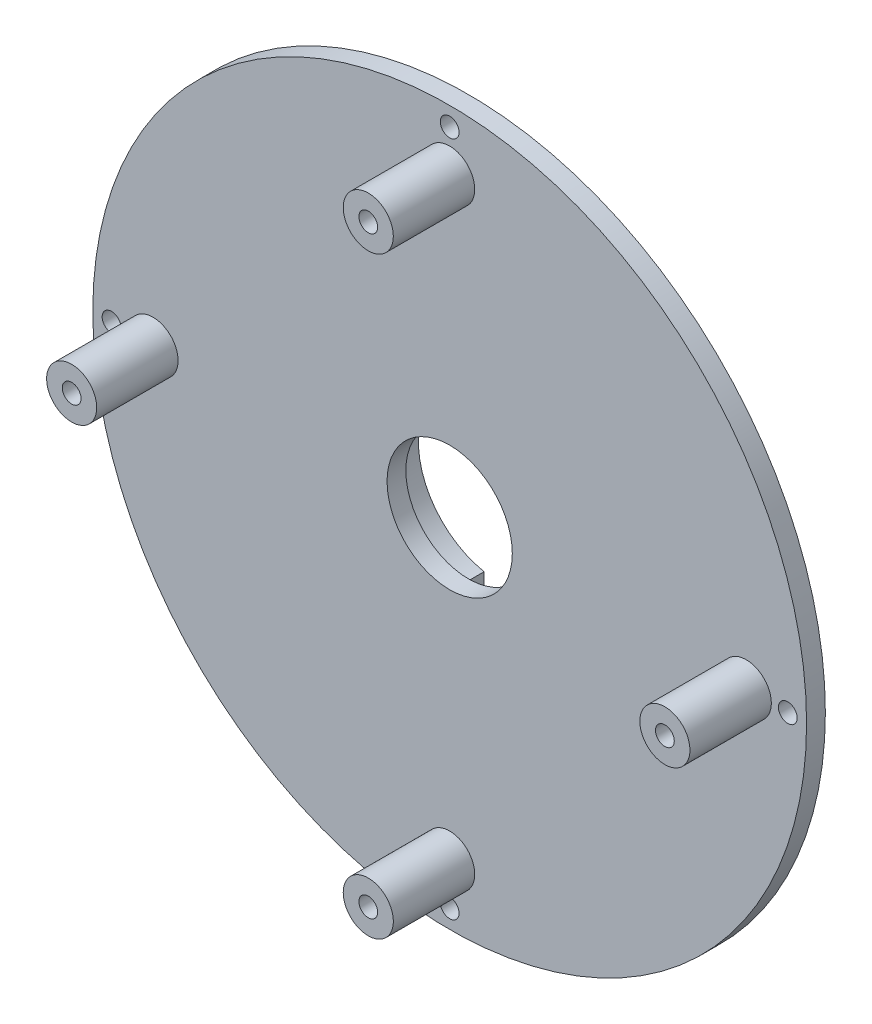
ISO-10303-21;
HEADER;
FILE_DESCRIPTION(('STEP AP214'),'2;1');
FILE_NAME('part.step','',(''),(''),'','','');
FILE_SCHEMA(('AUTOMOTIVE_DESIGN { 1 0 10303 214 1 1 1 1 }'));
ENDSEC;
DATA;
#1=APPLICATION_CONTEXT('core data for automotive mechanical design processes');
#2=APPLICATION_PROTOCOL_DEFINITION('international standard','automotive_design',2000,#1);
#3=PRODUCT_CONTEXT('',#1,'mechanical');
#4=PRODUCT('Part','Part','',(#3));
#5=PRODUCT_RELATED_PRODUCT_CATEGORY('part','',(#4));
#6=PRODUCT_DEFINITION_FORMATION('','',#4);
#7=PRODUCT_DEFINITION_CONTEXT('part definition',#1,'design');
#8=PRODUCT_DEFINITION('design','',#6,#7);
#9=PRODUCT_DEFINITION_SHAPE('','',#8);
#10=(LENGTH_UNIT() NAMED_UNIT(*) SI_UNIT(.MILLI.,.METRE.));
#11=(NAMED_UNIT(*) PLANE_ANGLE_UNIT() SI_UNIT($,.RADIAN.));
#12=(NAMED_UNIT(*) SI_UNIT($,.STERADIAN.) SOLID_ANGLE_UNIT());
#13=UNCERTAINTY_MEASURE_WITH_UNIT(LENGTH_MEASURE(1.E-05),#10,'distance_accuracy_value','');
#14=(GEOMETRIC_REPRESENTATION_CONTEXT(3) GLOBAL_UNCERTAINTY_ASSIGNED_CONTEXT((#13)) GLOBAL_UNIT_ASSIGNED_CONTEXT((#10,
#11,#12)) REPRESENTATION_CONTEXT('',''));
#15=CARTESIAN_POINT('',(0.,0.,0.));
#16=DIRECTION('',(0.,0.,1.));
#17=DIRECTION('',(1.,0.,0.));
#18=AXIS2_PLACEMENT_3D('',#15,#16,#17);
#19=CARTESIAN_POINT('',(0.,0.,-5.));
#20=DIRECTION('',(0.,0.,1.));
#21=DIRECTION('',(1.,0.,0.));
#22=AXIS2_PLACEMENT_3D('',#19,#20,#21);
#23=CYLINDRICAL_SURFACE('',#22,15.);
#24=CARTESIAN_POINT('',(0.,0.,-5.));
#25=DIRECTION('',(0.,0.,-1.));
#26=DIRECTION('',(-1.,0.,0.));
#27=AXIS2_PLACEMENT_3D('',#24,#25,#26);
#28=CIRCLE('',#27,15.);
#29=CARTESIAN_POINT('',(2.5,14.790199457749,-5.));
#30=VERTEX_POINT('',#29);
#31=CARTESIAN_POINT('',(2.5,-14.790199457749,-5.));
#32=VERTEX_POINT('',#31);
#33=EDGE_CURVE('E146',#30,#32,#28,.T.);
#34=ORIENTED_EDGE('',*,*,#33,.F.);
#35=DIRECTION('',(0.,0.,1.));
#36=VECTOR('',#35,1.);
#37=CARTESIAN_POINT('',(2.5,14.790199457749,-5.));
#38=LINE('',#37,#36);
#39=CARTESIAN_POINT('',(2.5,14.790199457749,0.));
#40=VERTEX_POINT('',#39);
#41=EDGE_CURVE('E187',#30,#40,#38,.T.);
#42=ORIENTED_EDGE('',*,*,#41,.T.);
#43=CARTESIAN_POINT('',(0.,0.,0.));
#44=DIRECTION('',(0.,0.,-1.));
#45=DIRECTION('',(-1.,0.,0.));
#46=AXIS2_PLACEMENT_3D('',#43,#44,#45);
#47=CIRCLE('',#46,15.);
#48=CARTESIAN_POINT('',(2.5,-14.790199457749,0.));
#49=VERTEX_POINT('',#48);
#50=EDGE_CURVE('E131',#40,#49,#47,.T.);
#51=ORIENTED_EDGE('',*,*,#50,.T.);
#52=DIRECTION('',(0.,0.,1.));
#53=VECTOR('',#52,1.);
#54=CARTESIAN_POINT('',(2.5,-14.790199457749,-5.));
#55=LINE('',#54,#53);
#56=EDGE_CURVE('E126',#49,#32,#55,.F.);
#57=ORIENTED_EDGE('',*,*,#56,.T.);
#58=EDGE_LOOP('',(#34,#42,#51,#57));
#59=FACE_BOUND('',#58,.T.);
#60=ADVANCED_FACE('F41',(#59),#23,.T.);
#61=CARTESIAN_POINT('',(0.,0.,-5.));
#62=DIRECTION('',(0.,0.,-1.));
#63=DIRECTION('',(-1.,0.,0.));
#64=AXIS2_PLACEMENT_3D('',#61,#62,#63);
#65=PLANE('',#64);
#66=DIRECTION('',(0.,-1.,0.));
#67=VECTOR('',#66,1.);
#68=CARTESIAN_POINT('',(2.5,-25.,-5.));
#69=LINE('',#68,#67);
#70=CARTESIAN_POINT('',(2.5,12.7573508221731,-5.));
#71=VERTEX_POINT('',#70);
#72=EDGE_CURVE('E168',#30,#71,#69,.T.);
#73=ORIENTED_EDGE('',*,*,#72,.F.);
#74=ORIENTED_EDGE('',*,*,#33,.T.);
#75=CARTESIAN_POINT('',(2.5,-12.7573508221731,-5.));
#76=VERTEX_POINT('',#75);
#77=EDGE_CURVE('E170',#76,#32,#69,.T.);
#78=ORIENTED_EDGE('',*,*,#77,.F.);
#79=CARTESIAN_POINT('',(0.,0.,-5.));
#80=DIRECTION('',(0.,0.,-1.));
#81=DIRECTION('',(-1.,0.,0.));
#82=AXIS2_PLACEMENT_3D('',#79,#80,#81);
#83=CIRCLE('',#82,13.);
#84=EDGE_CURVE('E158',#71,#76,#83,.T.);
#85=ORIENTED_EDGE('',*,*,#84,.F.);
#86=EDGE_LOOP('',(#73,#74,#78,#85));
#87=FACE_BOUND('',#86,.T.);
#88=ADVANCED_FACE('F166',(#87),#65,.T.);
#89=CARTESIAN_POINT('',(0.,0.,36.7695526217005));
#90=DIRECTION('',(0.,0.,-1.));
#91=DIRECTION('',(-1.,0.,0.));
#92=AXIS2_PLACEMENT_3D('',#89,#90,#91);
#93=CYLINDRICAL_SURFACE('',#92,13.);
#94=ORIENTED_EDGE('',*,*,#84,.T.);
#95=DIRECTION('',(0.,0.,-1.));
#96=VECTOR('',#95,1.);
#97=CARTESIAN_POINT('',(2.5,-12.7573508221731,36.7695526217005));
#98=LINE('',#97,#96);
#99=CARTESIAN_POINT('',(2.5,-12.7573508221731,0.));
#100=VERTEX_POINT('',#99);
#101=EDGE_CURVE('E11',#76,#100,#98,.F.);
#102=ORIENTED_EDGE('',*,*,#101,.T.);
#103=CARTESIAN_POINT('',(0.,0.,0.));
#104=DIRECTION('',(0.,0.,1.));
#105=DIRECTION('',(1.,0.,0.));
#106=AXIS2_PLACEMENT_3D('',#103,#104,#105);
#107=CIRCLE('',#106,13.);
#108=CARTESIAN_POINT('',(2.5,12.7573508221731,0.));
#109=VERTEX_POINT('',#108);
#110=EDGE_CURVE('E160',#109,#100,#107,.F.);
#111=ORIENTED_EDGE('',*,*,#110,.F.);
#112=DIRECTION('',(0.,0.,-1.));
#113=VECTOR('',#112,1.);
#114=CARTESIAN_POINT('',(2.5,12.7573508221731,36.7695526217005));
#115=LINE('',#114,#113);
#116=EDGE_CURVE('E50',#109,#71,#115,.T.);
#117=ORIENTED_EDGE('',*,*,#116,.T.);
#118=EDGE_LOOP('',(#94,#102,#111,#117));
#119=FACE_BOUND('',#118,.T.);
#120=ADVANCED_FACE('F157',(#119),#93,.F.);
#121=CARTESIAN_POINT('',(0.,0.,3.));
#122=DIRECTION('',(0.,0.,-1.));
#123=DIRECTION('',(-1.,0.,0.));
#124=AXIS2_PLACEMENT_3D('',#121,#122,#123);
#125=CYLINDRICAL_SURFACE('',#124,57.);
#126=CARTESIAN_POINT('',(0.,0.,3.));
#127=DIRECTION('',(0.,0.,1.));
#128=DIRECTION('',(1.,0.,0.));
#129=AXIS2_PLACEMENT_3D('',#126,#127,#128);
#130=CIRCLE('',#129,57.);
#131=CARTESIAN_POINT('',(57.,0.,3.));
#132=VERTEX_POINT('',#131);
#133=EDGE_CURVE('E132',#132,#132,#130,.T.);
#134=ORIENTED_EDGE('',*,*,#133,.F.);
#135=EDGE_LOOP('',(#134));
#136=FACE_BOUND('',#135,.T.);
#137=CARTESIAN_POINT('',(0.,0.,0.));
#138=DIRECTION('',(0.,0.,1.));
#139=DIRECTION('',(1.,0.,0.));
#140=AXIS2_PLACEMENT_3D('',#137,#138,#139);
#141=CIRCLE('',#140,57.);
#142=CARTESIAN_POINT('',(57.,0.,0.));
#143=VERTEX_POINT('',#142);
#144=EDGE_CURVE('E138',#143,#143,#141,.T.);
#145=ORIENTED_EDGE('',*,*,#144,.T.);
#146=EDGE_LOOP('',(#145));
#147=FACE_BOUND('',#146,.T.);
#148=ADVANCED_FACE('F43',(#136,#147),#125,.T.);
#149=CARTESIAN_POINT('',(0.,0.,3.));
#150=DIRECTION('',(0.,0.,1.));
#151=DIRECTION('',(1.,0.,0.));
#152=AXIS2_PLACEMENT_3D('',#149,#150,#151);
#153=PLANE('',#152);
#154=CARTESIAN_POINT('',(47.37,4.96174413062998E-13,3.));
#155=DIRECTION('',(0.,0.,1.));
#156=DIRECTION('',(0.,-1.,0.));
#157=AXIS2_PLACEMENT_3D('',#154,#155,#156);
#158=CIRCLE('',#157,4.);
#159=CARTESIAN_POINT('',(47.37,-3.9999999999995,3.));
#160=VERTEX_POINT('',#159);
#161=EDGE_CURVE('E272',#160,#160,#158,.T.);
#162=ORIENTED_EDGE('',*,*,#161,.F.);
#163=EDGE_LOOP('',(#162));
#164=FACE_BOUND('',#163,.T.);
#165=CARTESIAN_POINT('',(0.,-47.37,3.));
#166=DIRECTION('',(0.,0.,1.));
#167=DIRECTION('',(-1.,0.,0.));
#168=AXIS2_PLACEMENT_3D('',#165,#166,#167);
#169=CIRCLE('',#168,4.);
#170=CARTESIAN_POINT('',(-4.,-47.37,3.));
#171=VERTEX_POINT('',#170);
#172=EDGE_CURVE('E264',#171,#171,#169,.T.);
#173=ORIENTED_EDGE('',*,*,#172,.F.);
#174=EDGE_LOOP('',(#173));
#175=FACE_BOUND('',#174,.T.);
#176=CARTESIAN_POINT('',(-47.37,-1.65391471020999E-13,3.));
#177=DIRECTION('',(0.,0.,1.));
#178=DIRECTION('',(0.,1.,0.));
#179=AXIS2_PLACEMENT_3D('',#176,#177,#178);
#180=CIRCLE('',#179,4.);
#181=CARTESIAN_POINT('',(-47.37,3.99999999999984,3.));
#182=VERTEX_POINT('',#181);
#183=EDGE_CURVE('E256',#182,#182,#180,.T.);
#184=ORIENTED_EDGE('',*,*,#183,.F.);
#185=EDGE_LOOP('',(#184));
#186=FACE_BOUND('',#185,.T.);
#187=CARTESIAN_POINT('',(0.,47.37,3.));
#188=DIRECTION('',(0.,0.,1.));
#189=DIRECTION('',(1.,0.,0.));
#190=AXIS2_PLACEMENT_3D('',#187,#188,#189);
#191=CIRCLE('',#190,4.);
#192=CARTESIAN_POINT('',(4.,47.37,3.));
#193=VERTEX_POINT('',#192);
#194=EDGE_CURVE('E240',#193,#193,#191,.T.);
#195=ORIENTED_EDGE('',*,*,#194,.F.);
#196=EDGE_LOOP('',(#195));
#197=FACE_BOUND('',#196,.T.);
#198=CARTESIAN_POINT('',(0.,54.,3.));
#199=DIRECTION('',(0.,0.,1.));
#200=DIRECTION('',(1.,0.,0.));
#201=AXIS2_PLACEMENT_3D('',#198,#199,#200);
#202=CIRCLE('',#201,1.5);
#203=CARTESIAN_POINT('',(1.5,54.,3.));
#204=VERTEX_POINT('',#203);
#205=EDGE_CURVE('E205',#204,#204,#202,.F.);
#206=ORIENTED_EDGE('',*,*,#205,.T.);
#207=EDGE_LOOP('',(#206));
#208=FACE_BOUND('',#207,.T.);
#209=CARTESIAN_POINT('',(-54.0000000000023,2.29223882478963E-12,3.));
#210=DIRECTION('',(0.,0.,1.));
#211=DIRECTION('',(1.,0.,0.));
#212=AXIS2_PLACEMENT_3D('',#209,#210,#211);
#213=CIRCLE('',#212,1.50000000000257);
#214=CARTESIAN_POINT('',(-52.4999999999997,2.29223882478963E-12,3.));
#215=VERTEX_POINT('',#214);
#216=EDGE_CURVE('E226',#215,#215,#213,.F.);
#217=ORIENTED_EDGE('',*,*,#216,.T.);
#218=EDGE_LOOP('',(#217));
#219=FACE_BOUND('',#218,.T.);
#220=CARTESIAN_POINT('',(-4.58447764957926E-12,-54.,3.));
#221=DIRECTION('',(0.,0.,1.));
#222=DIRECTION('',(1.,0.,0.));
#223=AXIS2_PLACEMENT_3D('',#220,#221,#222);
#224=CIRCLE('',#223,1.50000000000573);
#225=CARTESIAN_POINT('',(1.50000000000115,-54.,3.));
#226=VERTEX_POINT('',#225);
#227=EDGE_CURVE('E218',#226,#226,#224,.F.);
#228=ORIENTED_EDGE('',*,*,#227,.T.);
#229=EDGE_LOOP('',(#228));
#230=FACE_BOUND('',#229,.T.);
#231=CARTESIAN_POINT('',(53.9999999999977,-2.29885191750503E-12,3.));
#232=DIRECTION('',(0.,0.,1.));
#233=DIRECTION('',(1.,0.,0.));
#234=AXIS2_PLACEMENT_3D('',#231,#232,#233);
#235=CIRCLE('',#234,1.5000000000045);
#236=CARTESIAN_POINT('',(55.5000000000022,-2.29885191750503E-12,3.));
#237=VERTEX_POINT('',#236);
#238=EDGE_CURVE('E208',#237,#237,#235,.F.);
#239=ORIENTED_EDGE('',*,*,#238,.T.);
#240=EDGE_LOOP('',(#239));
#241=FACE_BOUND('',#240,.T.);
#242=CARTESIAN_POINT('',(0.,0.,3.));
#243=DIRECTION('',(0.,0.,1.));
#244=DIRECTION('',(1.,0.,0.));
#245=AXIS2_PLACEMENT_3D('',#242,#243,#244);
#246=CIRCLE('',#245,10.);
#247=CARTESIAN_POINT('',(10.,0.,3.));
#248=VERTEX_POINT('',#247);
#249=EDGE_CURVE('E178',#248,#248,#246,.F.);
#250=ORIENTED_EDGE('',*,*,#249,.T.);
#251=EDGE_LOOP('',(#250));
#252=FACE_BOUND('',#251,.T.);
#253=ORIENTED_EDGE('',*,*,#133,.T.);
#254=EDGE_LOOP('',(#253));
#255=FACE_BOUND('',#254,.T.);
#256=ADVANCED_FACE('F320',(#164,#175,#186,#197,#208,#219,#230,#241,#252,#255),#153,.T.);
#257=CARTESIAN_POINT('',(0.,0.,0.));
#258=DIRECTION('',(0.,0.,1.));
#259=DIRECTION('',(1.,0.,0.));
#260=AXIS2_PLACEMENT_3D('',#257,#258,#259);
#261=PLANE('',#260);
#262=CARTESIAN_POINT('',(0.,54.,0.));
#263=DIRECTION('',(0.,0.,-1.));
#264=DIRECTION('',(-1.,0.,0.));
#265=AXIS2_PLACEMENT_3D('',#262,#263,#264);
#266=CIRCLE('',#265,1.5);
#267=CARTESIAN_POINT('',(-1.5,54.,0.));
#268=VERTEX_POINT('',#267);
#269=EDGE_CURVE('E230',#268,#268,#266,.T.);
#270=ORIENTED_EDGE('',*,*,#269,.F.);
#271=EDGE_LOOP('',(#270));
#272=FACE_BOUND('',#271,.T.);
#273=CARTESIAN_POINT('',(-54.0000000000023,2.29223882478963E-12,0.));
#274=DIRECTION('',(0.,0.,-1.));
#275=DIRECTION('',(-1.,0.,0.));
#276=AXIS2_PLACEMENT_3D('',#273,#274,#275);
#277=CIRCLE('',#276,1.50000000000257);
#278=CARTESIAN_POINT('',(-55.5000000000049,2.29223882478963E-12,0.));
#279=VERTEX_POINT('',#278);
#280=EDGE_CURVE('E222',#279,#279,#277,.T.);
#281=ORIENTED_EDGE('',*,*,#280,.F.);
#282=EDGE_LOOP('',(#281));
#283=FACE_BOUND('',#282,.T.);
#284=CARTESIAN_POINT('',(-4.58447764957926E-12,-54.,0.));
#285=DIRECTION('',(0.,0.,-1.));
#286=DIRECTION('',(-1.,0.,0.));
#287=AXIS2_PLACEMENT_3D('',#284,#285,#286);
#288=CIRCLE('',#287,1.50000000000573);
#289=CARTESIAN_POINT('',(-1.50000000001032,-54.,0.));
#290=VERTEX_POINT('',#289);
#291=EDGE_CURVE('E212',#290,#290,#288,.T.);
#292=ORIENTED_EDGE('',*,*,#291,.F.);
#293=EDGE_LOOP('',(#292));
#294=FACE_BOUND('',#293,.T.);
#295=CARTESIAN_POINT('',(53.9999999999977,-2.29885191750503E-12,0.));
#296=DIRECTION('',(0.,0.,-1.));
#297=DIRECTION('',(-1.,0.,0.));
#298=AXIS2_PLACEMENT_3D('',#295,#296,#297);
#299=CIRCLE('',#298,1.5000000000045);
#300=CARTESIAN_POINT('',(52.4999999999932,-2.29885191750503E-12,0.));
#301=VERTEX_POINT('',#300);
#302=EDGE_CURVE('E213',#301,#301,#299,.T.);
#303=ORIENTED_EDGE('',*,*,#302,.F.);
#304=EDGE_LOOP('',(#303));
#305=FACE_BOUND('',#304,.T.);
#306=DIRECTION('',(0.,-1.,0.));
#307=VECTOR('',#306,1.);
#308=CARTESIAN_POINT('',(2.5,-25.,0.));
#309=LINE('',#308,#307);
#310=EDGE_CURVE('E196',#100,#49,#309,.T.);
#311=ORIENTED_EDGE('',*,*,#310,.T.);
#312=ORIENTED_EDGE('',*,*,#50,.F.);
#313=EDGE_CURVE('E199',#40,#109,#309,.T.);
#314=ORIENTED_EDGE('',*,*,#313,.T.);
#315=ORIENTED_EDGE('',*,*,#110,.T.);
#316=EDGE_LOOP('',(#311,#312,#314,#315));
#317=FACE_BOUND('',#316,.T.);
#318=DIRECTION('',(0.,1.,0.));
#319=VECTOR('',#318,1.);
#320=CARTESIAN_POINT('',(-2.5,-25.,0.));
#321=LINE('',#320,#319);
#322=CARTESIAN_POINT('',(-2.5,12.7573508221731,0.));
#323=VERTEX_POINT('',#322);
#324=CARTESIAN_POINT('',(-2.5,14.790199457749,0.));
#325=VERTEX_POINT('',#324);
#326=EDGE_CURVE('E57',#323,#325,#321,.T.);
#327=ORIENTED_EDGE('',*,*,#326,.T.);
#328=CARTESIAN_POINT('',(-2.5,-14.790199457749,0.));
#329=VERTEX_POINT('',#328);
#330=EDGE_CURVE('E122',#329,#325,#47,.T.);
#331=ORIENTED_EDGE('',*,*,#330,.F.);
#332=CARTESIAN_POINT('',(-2.5,-12.7573508221731,0.));
#333=VERTEX_POINT('',#332);
#334=EDGE_CURVE('E105',#329,#333,#321,.T.);
#335=ORIENTED_EDGE('',*,*,#334,.T.);
#336=EDGE_CURVE('E176',#333,#323,#107,.F.);
#337=ORIENTED_EDGE('',*,*,#336,.T.);
#338=EDGE_LOOP('',(#327,#331,#335,#337));
#339=FACE_BOUND('',#338,.T.);
#340=ORIENTED_EDGE('',*,*,#144,.F.);
#341=EDGE_LOOP('',(#340));
#342=FACE_BOUND('',#341,.T.);
#343=CARTESIAN_POINT('',(0.,0.,0.));
#344=DIRECTION('',(0.,0.,-1.));
#345=DIRECTION('',(-1.,0.,0.));
#346=AXIS2_PLACEMENT_3D('',#343,#344,#345);
#347=CIRCLE('',#346,10.);
#348=CARTESIAN_POINT('',(-10.,0.,0.));
#349=VERTEX_POINT('',#348);
#350=EDGE_CURVE('E183',#349,#349,#347,.T.);
#351=ORIENTED_EDGE('',*,*,#350,.F.);
#352=EDGE_LOOP('',(#351));
#353=FACE_BOUND('',#352,.T.);
#354=ADVANCED_FACE('F128',(#272,#283,#294,#305,#317,#339,#342,#353),#261,.F.);
#355=CARTESIAN_POINT('',(-2.5,-14.790199457749,-5.));
#356=VERTEX_POINT('',#355);
#357=CARTESIAN_POINT('',(-2.5,14.790199457749,-5.));
#358=VERTEX_POINT('',#357);
#359=EDGE_CURVE('E124',#356,#358,#28,.T.);
#360=ORIENTED_EDGE('',*,*,#359,.F.);
#361=DIRECTION('',(0.,0.,1.));
#362=VECTOR('',#361,1.);
#363=CARTESIAN_POINT('',(-2.5,-14.790199457749,-5.));
#364=LINE('',#363,#362);
#365=EDGE_CURVE('E108',#356,#329,#364,.T.);
#366=ORIENTED_EDGE('',*,*,#365,.T.);
#367=ORIENTED_EDGE('',*,*,#330,.T.);
#368=DIRECTION('',(0.,0.,1.));
#369=VECTOR('',#368,1.);
#370=CARTESIAN_POINT('',(-2.5,14.790199457749,-5.));
#371=LINE('',#370,#369);
#372=EDGE_CURVE('E115',#325,#358,#371,.F.);
#373=ORIENTED_EDGE('',*,*,#372,.T.);
#374=EDGE_LOOP('',(#360,#366,#367,#373));
#375=FACE_BOUND('',#374,.T.);
#376=ADVANCED_FACE('F120',(#375),#23,.T.);
#377=DIRECTION('',(0.,1.,0.));
#378=VECTOR('',#377,1.);
#379=CARTESIAN_POINT('',(-2.5,-25.,-5.));
#380=LINE('',#379,#378);
#381=CARTESIAN_POINT('',(-2.5,-12.7573508221731,-5.));
#382=VERTEX_POINT('',#381);
#383=EDGE_CURVE('E65',#356,#382,#380,.T.);
#384=ORIENTED_EDGE('',*,*,#383,.F.);
#385=ORIENTED_EDGE('',*,*,#359,.T.);
#386=CARTESIAN_POINT('',(-2.5,12.7573508221731,-5.));
#387=VERTEX_POINT('',#386);
#388=EDGE_CURVE('E202',#387,#358,#380,.T.);
#389=ORIENTED_EDGE('',*,*,#388,.F.);
#390=EDGE_CURVE('E172',#382,#387,#83,.T.);
#391=ORIENTED_EDGE('',*,*,#390,.F.);
#392=EDGE_LOOP('',(#384,#385,#389,#391));
#393=FACE_BOUND('',#392,.T.);
#394=ADVANCED_FACE('F360',(#393),#65,.T.);
#395=ORIENTED_EDGE('',*,*,#390,.T.);
#396=DIRECTION('',(0.,0.,-1.));
#397=VECTOR('',#396,1.);
#398=CARTESIAN_POINT('',(-2.5,12.7573508221731,36.7695526217005));
#399=LINE('',#398,#397);
#400=EDGE_CURVE('E149',#387,#323,#399,.F.);
#401=ORIENTED_EDGE('',*,*,#400,.T.);
#402=ORIENTED_EDGE('',*,*,#336,.F.);
#403=DIRECTION('',(0.,0.,-1.));
#404=VECTOR('',#403,1.);
#405=CARTESIAN_POINT('',(-2.5,-12.7573508221731,36.7695526217005));
#406=LINE('',#405,#404);
#407=EDGE_CURVE('E109',#333,#382,#406,.T.);
#408=ORIENTED_EDGE('',*,*,#407,.T.);
#409=EDGE_LOOP('',(#395,#401,#402,#408));
#410=FACE_BOUND('',#409,.T.);
#411=ADVANCED_FACE('F351',(#410),#93,.F.);
#412=CARTESIAN_POINT('',(0.,0.,31.2842712474619));
#413=DIRECTION('',(0.,0.,-1.));
#414=DIRECTION('',(-1.,0.,0.));
#415=AXIS2_PLACEMENT_3D('',#412,#413,#414);
#416=CYLINDRICAL_SURFACE('',#415,10.);
#417=ORIENTED_EDGE('',*,*,#350,.T.);
#418=EDGE_LOOP('',(#417));
#419=FACE_BOUND('',#418,.T.);
#420=ORIENTED_EDGE('',*,*,#249,.F.);
#421=EDGE_LOOP('',(#420));
#422=FACE_BOUND('',#421,.T.);
#423=ADVANCED_FACE('F347',(#419,#422),#416,.F.);
#424=CARTESIAN_POINT('',(2.5,-25.,50.2493781056045));
#425=DIRECTION('',(1.,0.,0.));
#426=DIRECTION('',(0.,0.,-1.));
#427=AXIS2_PLACEMENT_3D('',#424,#425,#426);
#428=PLANE('',#427);
#429=ORIENTED_EDGE('',*,*,#310,.F.);
#430=ORIENTED_EDGE('',*,*,#101,.F.);
#431=ORIENTED_EDGE('',*,*,#77,.T.);
#432=ORIENTED_EDGE('',*,*,#56,.F.);
#433=EDGE_LOOP('',(#429,#430,#431,#432));
#434=FACE_BOUND('',#433,.T.);
#435=ADVANCED_FACE('F350',(#434),#428,.F.);
#436=CARTESIAN_POINT('',(-2.5,-25.,50.2493781056045));
#437=DIRECTION('',(-1.,0.,0.));
#438=DIRECTION('',(0.,0.,1.));
#439=AXIS2_PLACEMENT_3D('',#436,#437,#438);
#440=PLANE('',#439);
#441=ORIENTED_EDGE('',*,*,#383,.T.);
#442=ORIENTED_EDGE('',*,*,#407,.F.);
#443=ORIENTED_EDGE('',*,*,#334,.F.);
#444=ORIENTED_EDGE('',*,*,#365,.F.);
#445=EDGE_LOOP('',(#441,#442,#443,#444));
#446=FACE_BOUND('',#445,.T.);
#447=ADVANCED_FACE('F107',(#446),#440,.F.);
#448=ORIENTED_EDGE('',*,*,#72,.T.);
#449=ORIENTED_EDGE('',*,*,#116,.F.);
#450=ORIENTED_EDGE('',*,*,#313,.F.);
#451=ORIENTED_EDGE('',*,*,#41,.F.);
#452=EDGE_LOOP('',(#448,#449,#450,#451));
#453=FACE_BOUND('',#452,.T.);
#454=ADVANCED_FACE('F359',(#453),#428,.F.);
#455=ORIENTED_EDGE('',*,*,#326,.F.);
#456=ORIENTED_EDGE('',*,*,#400,.F.);
#457=ORIENTED_EDGE('',*,*,#388,.T.);
#458=ORIENTED_EDGE('',*,*,#372,.F.);
#459=EDGE_LOOP('',(#455,#456,#457,#458));
#460=FACE_BOUND('',#459,.T.);
#461=ADVANCED_FACE('F387',(#460),#440,.F.);
#462=CARTESIAN_POINT('',(53.9999999999977,-2.29885191750503E-12,7.2426406871355));
#463=DIRECTION('',(0.,0.,-1.));
#464=DIRECTION('',(-1.,0.,0.));
#465=AXIS2_PLACEMENT_3D('',#462,#463,#464);
#466=CYLINDRICAL_SURFACE('',#465,1.5000000000045);
#467=ORIENTED_EDGE('',*,*,#302,.T.);
#468=EDGE_LOOP('',(#467));
#469=FACE_BOUND('',#468,.T.);
#470=ORIENTED_EDGE('',*,*,#238,.F.);
#471=EDGE_LOOP('',(#470));
#472=FACE_BOUND('',#471,.T.);
#473=ADVANCED_FACE('F389',(#469,#472),#466,.F.);
#474=CARTESIAN_POINT('',(-4.58447764957926E-12,-54.,7.2426406871355));
#475=DIRECTION('',(0.,0.,-1.));
#476=DIRECTION('',(-1.,0.,0.));
#477=AXIS2_PLACEMENT_3D('',#474,#475,#476);
#478=CYLINDRICAL_SURFACE('',#477,1.50000000000573);
#479=ORIENTED_EDGE('',*,*,#291,.T.);
#480=EDGE_LOOP('',(#479));
#481=FACE_BOUND('',#480,.T.);
#482=ORIENTED_EDGE('',*,*,#227,.F.);
#483=EDGE_LOOP('',(#482));
#484=FACE_BOUND('',#483,.T.);
#485=ADVANCED_FACE('F395',(#481,#484),#478,.F.);
#486=CARTESIAN_POINT('',(-54.0000000000023,2.29223882478963E-12,7.2426406871355));
#487=DIRECTION('',(0.,0.,-1.));
#488=DIRECTION('',(-1.,0.,0.));
#489=AXIS2_PLACEMENT_3D('',#486,#487,#488);
#490=CYLINDRICAL_SURFACE('',#489,1.50000000000257);
#491=ORIENTED_EDGE('',*,*,#280,.T.);
#492=EDGE_LOOP('',(#491));
#493=FACE_BOUND('',#492,.T.);
#494=ORIENTED_EDGE('',*,*,#216,.F.);
#495=EDGE_LOOP('',(#494));
#496=FACE_BOUND('',#495,.T.);
#497=ADVANCED_FACE('F434',(#493,#496),#490,.F.);
#498=CARTESIAN_POINT('',(0.,54.,7.2426406871355));
#499=DIRECTION('',(0.,0.,-1.));
#500=DIRECTION('',(-1.,0.,0.));
#501=AXIS2_PLACEMENT_3D('',#498,#499,#500);
#502=CYLINDRICAL_SURFACE('',#501,1.5);
#503=ORIENTED_EDGE('',*,*,#269,.T.);
#504=EDGE_LOOP('',(#503));
#505=FACE_BOUND('',#504,.T.);
#506=ORIENTED_EDGE('',*,*,#205,.F.);
#507=EDGE_LOOP('',(#506));
#508=FACE_BOUND('',#507,.T.);
#509=ADVANCED_FACE('F444',(#505,#508),#502,.F.);
#510=CARTESIAN_POINT('',(0.,47.37,16.));
#511=DIRECTION('',(0.,0.,-1.));
#512=DIRECTION('',(-1.,0.,0.));
#513=AXIS2_PLACEMENT_3D('',#510,#511,#512);
#514=CYLINDRICAL_SURFACE('',#513,4.);
#515=CARTESIAN_POINT('',(0.,47.37,16.));
#516=DIRECTION('',(0.,0.,1.));
#517=DIRECTION('',(1.,0.,0.));
#518=AXIS2_PLACEMENT_3D('',#515,#516,#517);
#519=CIRCLE('',#518,4.);
#520=CARTESIAN_POINT('',(4.,47.37,16.));
#521=VERTEX_POINT('',#520);
#522=EDGE_CURVE('E217',#521,#521,#519,.T.);
#523=ORIENTED_EDGE('',*,*,#522,.F.);
#524=EDGE_LOOP('',(#523));
#525=FACE_BOUND('',#524,.T.);
#526=ORIENTED_EDGE('',*,*,#194,.T.);
#527=EDGE_LOOP('',(#526));
#528=FACE_BOUND('',#527,.T.);
#529=ADVANCED_FACE('F454',(#525,#528),#514,.T.);
#530=CARTESIAN_POINT('',(0.,47.37,16.));
#531=DIRECTION('',(0.,0.,1.));
#532=DIRECTION('',(1.,0.,0.));
#533=AXIS2_PLACEMENT_3D('',#530,#531,#532);
#534=PLANE('',#533);
#535=CARTESIAN_POINT('',(0.,47.37,16.));
#536=DIRECTION('',(0.,0.,1.));
#537=DIRECTION('',(1.,0.,0.));
#538=AXIS2_PLACEMENT_3D('',#535,#536,#537);
#539=CIRCLE('',#538,1.5);
#540=CARTESIAN_POINT('',(1.5,47.37,16.));
#541=VERTEX_POINT('',#540);
#542=EDGE_CURVE('E251',#541,#541,#539,.T.);
#543=ORIENTED_EDGE('',*,*,#542,.F.);
#544=EDGE_LOOP('',(#543));
#545=FACE_BOUND('',#544,.T.);
#546=ORIENTED_EDGE('',*,*,#522,.T.);
#547=EDGE_LOOP('',(#546));
#548=FACE_BOUND('',#547,.T.);
#549=ADVANCED_FACE('F464',(#545,#548),#534,.T.);
#550=CARTESIAN_POINT('',(0.,47.37,-1.24264068711929));
#551=DIRECTION('',(0.,0.,1.));
#552=DIRECTION('',(1.,0.,0.));
#553=AXIS2_PLACEMENT_3D('',#550,#551,#552);
#554=CYLINDRICAL_SURFACE('',#553,1.5);
#555=CARTESIAN_POINT('',(0.,47.37,3.));
#556=DIRECTION('',(0.,0.,1.));
#557=DIRECTION('',(1.,0.,0.));
#558=AXIS2_PLACEMENT_3D('',#555,#556,#557);
#559=CIRCLE('',#558,1.5);
#560=CARTESIAN_POINT('',(1.5,47.37,3.));
#561=VERTEX_POINT('',#560);
#562=EDGE_CURVE('E244',#561,#561,#559,.F.);
#563=ORIENTED_EDGE('',*,*,#562,.T.);
#564=EDGE_LOOP('',(#563));
#565=FACE_BOUND('',#564,.T.);
#566=ORIENTED_EDGE('',*,*,#542,.T.);
#567=EDGE_LOOP('',(#566));
#568=FACE_BOUND('',#567,.T.);
#569=ADVANCED_FACE('F474',(#565,#568),#554,.F.);
#570=CARTESIAN_POINT('',(0.,0.,3.));
#571=DIRECTION('',(0.,0.,1.));
#572=DIRECTION('',(1.,0.,0.));
#573=AXIS2_PLACEMENT_3D('',#570,#571,#572);
#574=PLANE('',#573);
#575=ORIENTED_EDGE('',*,*,#562,.F.);
#576=EDGE_LOOP('',(#575));
#577=FACE_BOUND('',#576,.T.);
#578=ADVANCED_FACE('F316',(#577),#574,.T.);
#579=CARTESIAN_POINT('',(-47.37,-1.65391471020999E-13,16.));
#580=DIRECTION('',(0.,0.,-1.));
#581=DIRECTION('',(-1.,0.,0.));
#582=AXIS2_PLACEMENT_3D('',#579,#580,#581);
#583=CYLINDRICAL_SURFACE('',#582,4.);
#584=CARTESIAN_POINT('',(-47.37,-1.65391471020999E-13,16.));
#585=DIRECTION('',(0.,0.,1.));
#586=DIRECTION('',(0.,1.,0.));
#587=AXIS2_PLACEMENT_3D('',#584,#585,#586);
#588=CIRCLE('',#587,4.);
#589=CARTESIAN_POINT('',(-47.37,3.99999999999984,16.));
#590=VERTEX_POINT('',#589);
#591=EDGE_CURVE('E255',#590,#590,#588,.T.);
#592=ORIENTED_EDGE('',*,*,#591,.F.);
#593=EDGE_LOOP('',(#592));
#594=FACE_BOUND('',#593,.T.);
#595=ORIENTED_EDGE('',*,*,#183,.T.);
#596=EDGE_LOOP('',(#595));
#597=FACE_BOUND('',#596,.T.);
#598=ADVANCED_FACE('F310',(#594,#597),#583,.T.);
#599=CARTESIAN_POINT('',(-47.37,-1.65391471020999E-13,16.));
#600=DIRECTION('',(0.,0.,1.));
#601=DIRECTION('',(0.,1.,0.));
#602=AXIS2_PLACEMENT_3D('',#599,#600,#601);
#603=PLANE('',#602);
#604=CARTESIAN_POINT('',(-47.37,-1.65391471020999E-13,16.));
#605=DIRECTION('',(0.,0.,1.));
#606=DIRECTION('',(0.,1.,0.));
#607=AXIS2_PLACEMENT_3D('',#604,#605,#606);
#608=CIRCLE('',#607,1.5);
#609=CARTESIAN_POINT('',(-47.37,1.49999999999984,16.));
#610=VERTEX_POINT('',#609);
#611=EDGE_CURVE('E293',#610,#610,#608,.T.);
#612=ORIENTED_EDGE('',*,*,#611,.F.);
#613=EDGE_LOOP('',(#612));
#614=FACE_BOUND('',#613,.T.);
#615=ORIENTED_EDGE('',*,*,#591,.T.);
#616=EDGE_LOOP('',(#615));
#617=FACE_BOUND('',#616,.T.);
#618=ADVANCED_FACE('F306',(#614,#617),#603,.T.);
#619=CARTESIAN_POINT('',(0.,-47.37,16.));
#620=DIRECTION('',(0.,0.,-1.));
#621=DIRECTION('',(-1.,0.,0.));
#622=AXIS2_PLACEMENT_3D('',#619,#620,#621);
#623=CYLINDRICAL_SURFACE('',#622,4.);
#624=CARTESIAN_POINT('',(0.,-47.37,16.));
#625=DIRECTION('',(0.,0.,1.));
#626=DIRECTION('',(-1.,0.,0.));
#627=AXIS2_PLACEMENT_3D('',#624,#625,#626);
#628=CIRCLE('',#627,4.);
#629=CARTESIAN_POINT('',(-4.,-47.37,16.));
#630=VERTEX_POINT('',#629);
#631=EDGE_CURVE('E260',#630,#630,#628,.T.);
#632=ORIENTED_EDGE('',*,*,#631,.F.);
#633=EDGE_LOOP('',(#632));
#634=FACE_BOUND('',#633,.T.);
#635=ORIENTED_EDGE('',*,*,#172,.T.);
#636=EDGE_LOOP('',(#635));
#637=FACE_BOUND('',#636,.T.);
#638=ADVANCED_FACE('F309',(#634,#637),#623,.T.);
#639=CARTESIAN_POINT('',(0.,-47.37,16.));
#640=DIRECTION('',(0.,0.,1.));
#641=DIRECTION('',(-1.,0.,0.));
#642=AXIS2_PLACEMENT_3D('',#639,#640,#641);
#643=PLANE('',#642);
#644=CARTESIAN_POINT('',(0.,-47.37,16.));
#645=DIRECTION('',(0.,0.,1.));
#646=DIRECTION('',(-1.,0.,0.));
#647=AXIS2_PLACEMENT_3D('',#644,#645,#646);
#648=CIRCLE('',#647,1.5);
#649=CARTESIAN_POINT('',(-1.5,-47.37,16.));
#650=VERTEX_POINT('',#649);
#651=EDGE_CURVE('E284',#650,#650,#648,.T.);
#652=ORIENTED_EDGE('',*,*,#651,.F.);
#653=EDGE_LOOP('',(#652));
#654=FACE_BOUND('',#653,.T.);
#655=ORIENTED_EDGE('',*,*,#631,.T.);
#656=EDGE_LOOP('',(#655));
#657=FACE_BOUND('',#656,.T.);
#658=ADVANCED_FACE('F522',(#654,#657),#643,.T.);
#659=CARTESIAN_POINT('',(47.37,4.96174413062998E-13,16.));
#660=DIRECTION('',(0.,0.,-1.));
#661=DIRECTION('',(-1.,0.,0.));
#662=AXIS2_PLACEMENT_3D('',#659,#660,#661);
#663=CYLINDRICAL_SURFACE('',#662,4.);
#664=CARTESIAN_POINT('',(47.37,4.96174413062998E-13,16.));
#665=DIRECTION('',(0.,0.,1.));
#666=DIRECTION('',(0.,-1.,0.));
#667=AXIS2_PLACEMENT_3D('',#664,#665,#666);
#668=CIRCLE('',#667,4.);
#669=CARTESIAN_POINT('',(47.37,-3.9999999999995,16.));
#670=VERTEX_POINT('',#669);
#671=EDGE_CURVE('E268',#670,#670,#668,.T.);
#672=ORIENTED_EDGE('',*,*,#671,.F.);
#673=EDGE_LOOP('',(#672));
#674=FACE_BOUND('',#673,.T.);
#675=ORIENTED_EDGE('',*,*,#161,.T.);
#676=EDGE_LOOP('',(#675));
#677=FACE_BOUND('',#676,.T.);
#678=ADVANCED_FACE('F532',(#674,#677),#663,.T.);
#679=CARTESIAN_POINT('',(47.37,4.96174413062998E-13,16.));
#680=DIRECTION('',(0.,0.,1.));
#681=DIRECTION('',(0.,-1.,0.));
#682=AXIS2_PLACEMENT_3D('',#679,#680,#681);
#683=PLANE('',#682);
#684=CARTESIAN_POINT('',(47.37,4.96174413062998E-13,16.));
#685=DIRECTION('',(0.,0.,1.));
#686=DIRECTION('',(0.,-1.,0.));
#687=AXIS2_PLACEMENT_3D('',#684,#685,#686);
#688=CIRCLE('',#687,1.5);
#689=CARTESIAN_POINT('',(47.37,-1.4999999999995,16.));
#690=VERTEX_POINT('',#689);
#691=EDGE_CURVE('E285',#690,#690,#688,.T.);
#692=ORIENTED_EDGE('',*,*,#691,.F.);
#693=EDGE_LOOP('',(#692));
#694=FACE_BOUND('',#693,.T.);
#695=ORIENTED_EDGE('',*,*,#671,.T.);
#696=EDGE_LOOP('',(#695));
#697=FACE_BOUND('',#696,.T.);
#698=ADVANCED_FACE('F542',(#694,#697),#683,.T.);
#699=CARTESIAN_POINT('',(47.37,4.96174413062998E-13,-1.24264068711929));
#700=DIRECTION('',(0.,0.,1.));
#701=DIRECTION('',(1.,0.,0.));
#702=AXIS2_PLACEMENT_3D('',#699,#700,#701);
#703=CYLINDRICAL_SURFACE('',#702,1.5);
#704=CARTESIAN_POINT('',(47.37,4.96174413062998E-13,3.));
#705=DIRECTION('',(0.,0.,1.));
#706=DIRECTION('',(1.,0.,0.));
#707=AXIS2_PLACEMENT_3D('',#704,#705,#706);
#708=CIRCLE('',#707,1.5);
#709=CARTESIAN_POINT('',(48.87,4.96174413062998E-13,3.));
#710=VERTEX_POINT('',#709);
#711=EDGE_CURVE('E280',#710,#710,#708,.F.);
#712=ORIENTED_EDGE('',*,*,#711,.T.);
#713=EDGE_LOOP('',(#712));
#714=FACE_BOUND('',#713,.T.);
#715=ORIENTED_EDGE('',*,*,#691,.T.);
#716=EDGE_LOOP('',(#715));
#717=FACE_BOUND('',#716,.T.);
#718=ADVANCED_FACE('F552',(#714,#717),#703,.F.);
#719=CARTESIAN_POINT('',(0.,0.,3.));
#720=DIRECTION('',(0.,0.,1.));
#721=DIRECTION('',(1.,0.,0.));
#722=AXIS2_PLACEMENT_3D('',#719,#720,#721);
#723=PLANE('',#722);
#724=ORIENTED_EDGE('',*,*,#711,.F.);
#725=EDGE_LOOP('',(#724));
#726=FACE_BOUND('',#725,.T.);
#727=ADVANCED_FACE('F562',(#726),#723,.T.);
#728=CARTESIAN_POINT('',(0.,-47.37,-1.24264068711929));
#729=DIRECTION('',(0.,0.,1.));
#730=DIRECTION('',(1.,0.,0.));
#731=AXIS2_PLACEMENT_3D('',#728,#729,#730);
#732=CYLINDRICAL_SURFACE('',#731,1.5);
#733=CARTESIAN_POINT('',(0.,-47.37,3.));
#734=DIRECTION('',(0.,0.,1.));
#735=DIRECTION('',(1.,0.,0.));
#736=AXIS2_PLACEMENT_3D('',#733,#734,#735);
#737=CIRCLE('',#736,1.5);
#738=CARTESIAN_POINT('',(1.5,-47.37,3.));
#739=VERTEX_POINT('',#738);
#740=EDGE_CURVE('E289',#739,#739,#737,.F.);
#741=ORIENTED_EDGE('',*,*,#740,.T.);
#742=EDGE_LOOP('',(#741));
#743=FACE_BOUND('',#742,.T.);
#744=ORIENTED_EDGE('',*,*,#651,.T.);
#745=EDGE_LOOP('',(#744));
#746=FACE_BOUND('',#745,.T.);
#747=ADVANCED_FACE('F572',(#743,#746),#732,.F.);
#748=CARTESIAN_POINT('',(0.,0.,3.));
#749=DIRECTION('',(0.,0.,1.));
#750=DIRECTION('',(1.,0.,0.));
#751=AXIS2_PLACEMENT_3D('',#748,#749,#750);
#752=PLANE('',#751);
#753=ORIENTED_EDGE('',*,*,#740,.F.);
#754=EDGE_LOOP('',(#753));
#755=FACE_BOUND('',#754,.T.);
#756=ADVANCED_FACE('F582',(#755),#752,.T.);
#757=CARTESIAN_POINT('',(-47.37,-1.65391471020999E-13,-1.24264068711929));
#758=DIRECTION('',(0.,0.,1.));
#759=DIRECTION('',(1.,0.,0.));
#760=AXIS2_PLACEMENT_3D('',#757,#758,#759);
#761=CYLINDRICAL_SURFACE('',#760,1.5);
#762=CARTESIAN_POINT('',(-47.37,-1.65391471020999E-13,3.));
#763=DIRECTION('',(0.,0.,1.));
#764=DIRECTION('',(1.,0.,0.));
#765=AXIS2_PLACEMENT_3D('',#762,#763,#764);
#766=CIRCLE('',#765,1.5);
#767=CARTESIAN_POINT('',(-45.87,-1.65391471020999E-13,3.));
#768=VERTEX_POINT('',#767);
#769=EDGE_CURVE('E276',#768,#768,#766,.F.);
#770=ORIENTED_EDGE('',*,*,#769,.T.);
#771=EDGE_LOOP('',(#770));
#772=FACE_BOUND('',#771,.T.);
#773=ORIENTED_EDGE('',*,*,#611,.T.);
#774=EDGE_LOOP('',(#773));
#775=FACE_BOUND('',#774,.T.);
#776=ADVANCED_FACE('F304',(#772,#775),#761,.F.);
#777=CARTESIAN_POINT('',(0.,0.,3.));
#778=DIRECTION('',(0.,0.,1.));
#779=DIRECTION('',(1.,0.,0.));
#780=AXIS2_PLACEMENT_3D('',#777,#778,#779);
#781=PLANE('',#780);
#782=ORIENTED_EDGE('',*,*,#769,.F.);
#783=EDGE_LOOP('',(#782));
#784=FACE_BOUND('',#783,.T.);
#785=ADVANCED_FACE('F601',(#784),#781,.T.);
#786=CLOSED_SHELL('',(#60,#88,#120,#148,#256,#354,#376,#394,#411,#423,#435,#447,#454,#461,#473,
#485,#497,#509,#529,#549,#569,#578,#598,#618,#638,#658,#678,#698,#718,#727,#747,#756,#776,#785));
#787=MANIFOLD_SOLID_BREP('B2',#786);
#788=ADVANCED_BREP_SHAPE_REPRESENTATION('',(#18,#787),#14);
#789=SHAPE_DEFINITION_REPRESENTATION(#9,#788);
ENDSEC;
END-ISO-10303-21;
